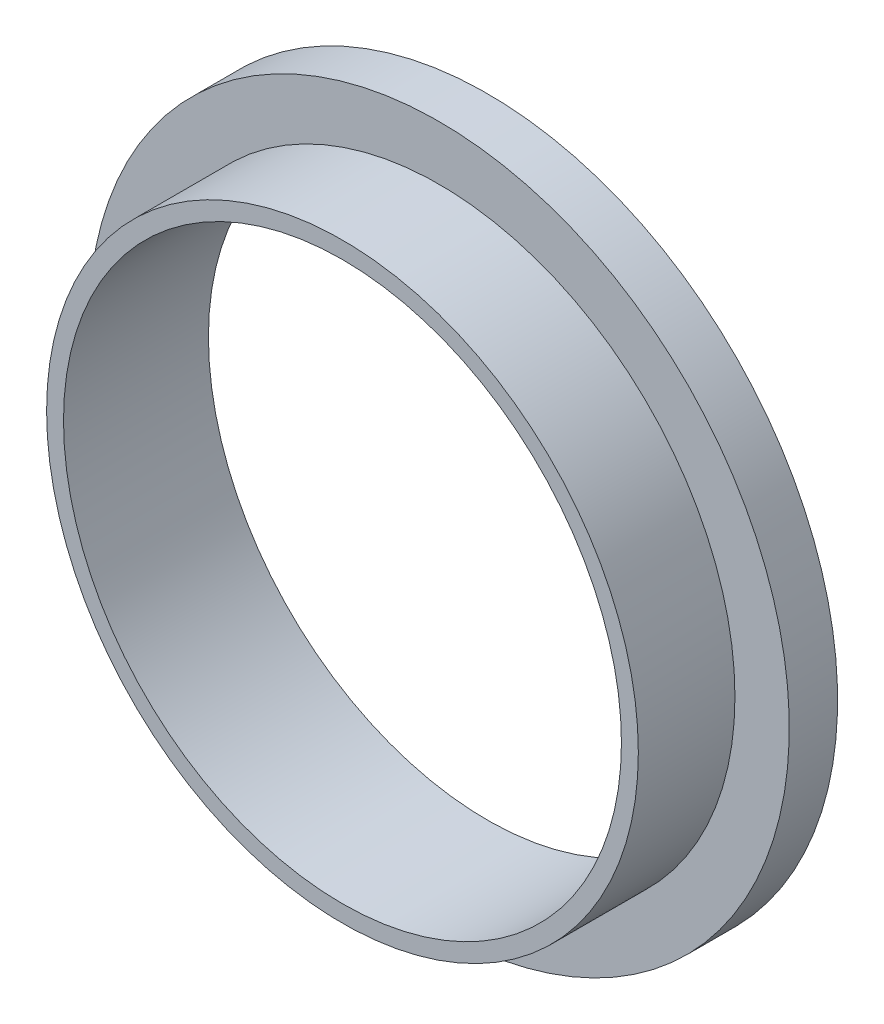
ISO-10303-21;
HEADER;
FILE_DESCRIPTION(('STEP AP214'),'2;1');
FILE_NAME('part.step','',(''),(''),'','','');
FILE_SCHEMA(('AUTOMOTIVE_DESIGN { 1 0 10303 214 1 1 1 1 }'));
ENDSEC;
DATA;
#1=APPLICATION_CONTEXT('core data for automotive mechanical design processes');
#2=APPLICATION_PROTOCOL_DEFINITION('international standard','automotive_design',2000,#1);
#3=PRODUCT_CONTEXT('',#1,'mechanical');
#4=PRODUCT('Part','Part','',(#3));
#5=PRODUCT_RELATED_PRODUCT_CATEGORY('part','',(#4));
#6=PRODUCT_DEFINITION_FORMATION('','',#4);
#7=PRODUCT_DEFINITION_CONTEXT('part definition',#1,'design');
#8=PRODUCT_DEFINITION('design','',#6,#7);
#9=PRODUCT_DEFINITION_SHAPE('','',#8);
#10=(LENGTH_UNIT() NAMED_UNIT(*) SI_UNIT(.MILLI.,.METRE.));
#11=(NAMED_UNIT(*) PLANE_ANGLE_UNIT() SI_UNIT($,.RADIAN.));
#12=(NAMED_UNIT(*) SI_UNIT($,.STERADIAN.) SOLID_ANGLE_UNIT());
#13=UNCERTAINTY_MEASURE_WITH_UNIT(LENGTH_MEASURE(1.E-05),#10,'distance_accuracy_value','');
#14=(GEOMETRIC_REPRESENTATION_CONTEXT(3) GLOBAL_UNCERTAINTY_ASSIGNED_CONTEXT((#13)) GLOBAL_UNIT_ASSIGNED_CONTEXT((#10,
#11,#12)) REPRESENTATION_CONTEXT('',''));
#15=CARTESIAN_POINT('',(0.,0.,0.));
#16=DIRECTION('',(0.,0.,1.));
#17=DIRECTION('',(1.,0.,0.));
#18=AXIS2_PLACEMENT_3D('',#15,#16,#17);
#19=CARTESIAN_POINT('',(0.,0.,4.));
#20=DIRECTION('',(0.,0.,-1.));
#21=DIRECTION('',(-1.,0.,0.));
#22=AXIS2_PLACEMENT_3D('',#19,#20,#21);
#23=CYLINDRICAL_SURFACE('',#22,12.25);
#24=CARTESIAN_POINT('',(0.,0.,4.));
#25=DIRECTION('',(0.,0.,1.));
#26=DIRECTION('',(1.,0.,0.));
#27=AXIS2_PLACEMENT_3D('',#24,#25,#26);
#28=CIRCLE('',#27,12.25);
#29=CARTESIAN_POINT('',(12.25,0.,4.));
#30=VERTEX_POINT('',#29);
#31=EDGE_CURVE('E10',#30,#30,#28,.T.);
#32=ORIENTED_EDGE('',*,*,#31,.F.);
#33=EDGE_LOOP('',(#32));
#34=FACE_BOUND('',#33,.T.);
#35=CARTESIAN_POINT('',(0.,0.,0.));
#36=DIRECTION('',(0.,0.,1.));
#37=DIRECTION('',(1.,0.,0.));
#38=AXIS2_PLACEMENT_3D('',#35,#36,#37);
#39=CIRCLE('',#38,12.25);
#40=CARTESIAN_POINT('',(12.25,0.,0.));
#41=VERTEX_POINT('',#40);
#42=EDGE_CURVE('E34',#41,#41,#39,.T.);
#43=ORIENTED_EDGE('',*,*,#42,.T.);
#44=EDGE_LOOP('',(#43));
#45=FACE_BOUND('',#44,.T.);
#46=ADVANCED_FACE('F31',(#34,#45),#23,.T.);
#47=CARTESIAN_POINT('',(0.,0.,4.));
#48=DIRECTION('',(0.,0.,1.));
#49=DIRECTION('',(1.,0.,0.));
#50=AXIS2_PLACEMENT_3D('',#47,#48,#49);
#51=PLANE('',#50);
#52=CARTESIAN_POINT('',(0.,0.,4.));
#53=DIRECTION('',(0.,0.,1.));
#54=DIRECTION('',(1.,0.,0.));
#55=AXIS2_PLACEMENT_3D('',#52,#53,#54);
#56=CIRCLE('',#55,11.55);
#57=CARTESIAN_POINT('',(11.55,0.,4.));
#58=VERTEX_POINT('',#57);
#59=EDGE_CURVE('E46',#58,#58,#56,.T.);
#60=ORIENTED_EDGE('',*,*,#59,.F.);
#61=EDGE_LOOP('',(#60));
#62=FACE_BOUND('',#61,.T.);
#63=ORIENTED_EDGE('',*,*,#31,.T.);
#64=EDGE_LOOP('',(#63));
#65=FACE_BOUND('',#64,.T.);
#66=ADVANCED_FACE('F67',(#62,#65),#51,.T.);
#67=CARTESIAN_POINT('',(0.,0.,-2.));
#68=DIRECTION('',(0.,0.,1.));
#69=DIRECTION('',(1.,0.,0.));
#70=AXIS2_PLACEMENT_3D('',#67,#68,#69);
#71=CYLINDRICAL_SURFACE('',#70,14.5);
#72=CARTESIAN_POINT('',(0.,0.,-2.));
#73=DIRECTION('',(0.,0.,-1.));
#74=DIRECTION('',(-1.,0.,0.));
#75=AXIS2_PLACEMENT_3D('',#72,#73,#74);
#76=CIRCLE('',#75,14.5);
#77=CARTESIAN_POINT('',(-14.5,0.,-2.));
#78=VERTEX_POINT('',#77);
#79=EDGE_CURVE('E41',#78,#78,#76,.T.);
#80=ORIENTED_EDGE('',*,*,#79,.F.);
#81=EDGE_LOOP('',(#80));
#82=FACE_BOUND('',#81,.T.);
#83=CARTESIAN_POINT('',(0.,0.,0.));
#84=DIRECTION('',(0.,0.,-1.));
#85=DIRECTION('',(-1.,0.,0.));
#86=AXIS2_PLACEMENT_3D('',#83,#84,#85);
#87=CIRCLE('',#86,14.5);
#88=CARTESIAN_POINT('',(-14.5,0.,0.));
#89=VERTEX_POINT('',#88);
#90=EDGE_CURVE('E43',#89,#89,#87,.T.);
#91=ORIENTED_EDGE('',*,*,#90,.T.);
#92=EDGE_LOOP('',(#91));
#93=FACE_BOUND('',#92,.T.);
#94=ADVANCED_FACE('F61',(#82,#93),#71,.T.);
#95=CARTESIAN_POINT('',(0.,0.,-2.));
#96=DIRECTION('',(0.,0.,-1.));
#97=DIRECTION('',(-1.,0.,0.));
#98=AXIS2_PLACEMENT_3D('',#95,#96,#97);
#99=PLANE('',#98);
#100=CARTESIAN_POINT('',(0.,0.,-2.));
#101=DIRECTION('',(0.,0.,-1.));
#102=DIRECTION('',(-1.,0.,0.));
#103=AXIS2_PLACEMENT_3D('',#100,#101,#102);
#104=CIRCLE('',#103,11.55);
#105=CARTESIAN_POINT('',(-11.55,0.,-2.));
#106=VERTEX_POINT('',#105);
#107=EDGE_CURVE('E51',#106,#106,#104,.T.);
#108=ORIENTED_EDGE('',*,*,#107,.F.);
#109=EDGE_LOOP('',(#108));
#110=FACE_BOUND('',#109,.T.);
#111=ORIENTED_EDGE('',*,*,#79,.T.);
#112=EDGE_LOOP('',(#111));
#113=FACE_BOUND('',#112,.T.);
#114=ADVANCED_FACE('F57',(#110,#113),#99,.T.);
#115=CARTESIAN_POINT('',(0.,0.,0.));
#116=DIRECTION('',(0.,0.,-1.));
#117=DIRECTION('',(-1.,0.,0.));
#118=AXIS2_PLACEMENT_3D('',#115,#116,#117);
#119=PLANE('',#118);
#120=ORIENTED_EDGE('',*,*,#42,.F.);
#121=EDGE_LOOP('',(#120));
#122=FACE_BOUND('',#121,.T.);
#123=ORIENTED_EDGE('',*,*,#90,.F.);
#124=EDGE_LOOP('',(#123));
#125=FACE_BOUND('',#124,.T.);
#126=ADVANCED_FACE('F60',(#122,#125),#119,.F.);
#127=CARTESIAN_POINT('',(0.,0.,8.));
#128=DIRECTION('',(0.,0.,-1.));
#129=DIRECTION('',(-1.,0.,0.));
#130=AXIS2_PLACEMENT_3D('',#127,#128,#129);
#131=CYLINDRICAL_SURFACE('',#130,11.55);
#132=ORIENTED_EDGE('',*,*,#59,.T.);
#133=EDGE_LOOP('',(#132));
#134=FACE_BOUND('',#133,.T.);
#135=ORIENTED_EDGE('',*,*,#107,.T.);
#136=EDGE_LOOP('',(#135));
#137=FACE_BOUND('',#136,.T.);
#138=ADVANCED_FACE('F55',(#134,#137),#131,.F.);
#139=CLOSED_SHELL('',(#46,#66,#94,#114,#126,#138));
#140=MANIFOLD_SOLID_BREP('B2',#139);
#141=ADVANCED_BREP_SHAPE_REPRESENTATION('',(#18,#140),#14);
#142=SHAPE_DEFINITION_REPRESENTATION(#9,#141);
ENDSEC;
END-ISO-10303-21;
